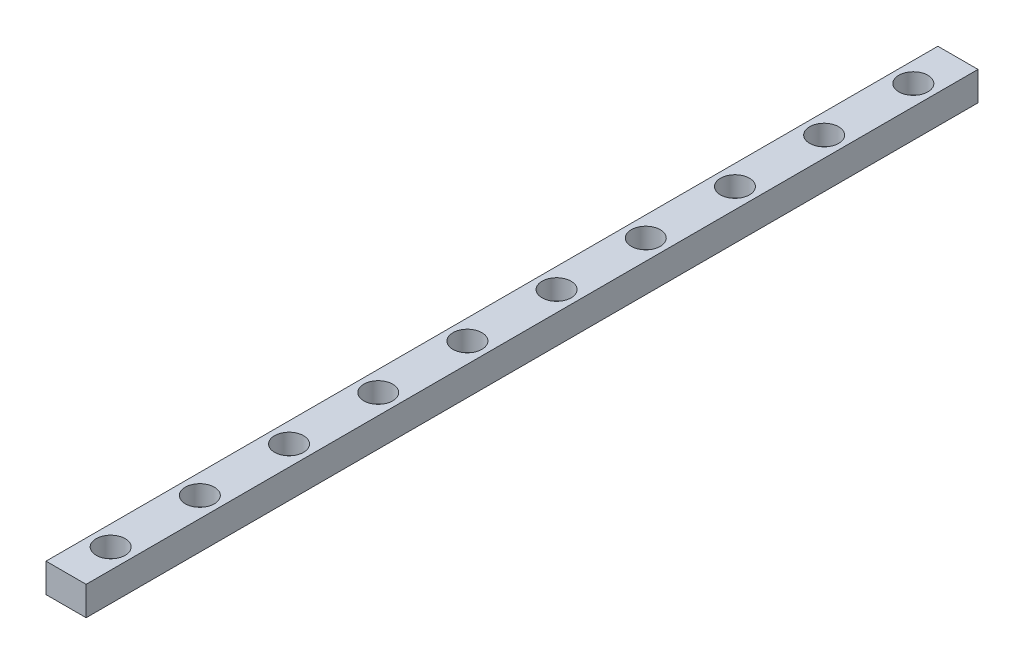
ISO-10303-21;
HEADER;
FILE_DESCRIPTION(('STEP AP214'),'2;1');
FILE_NAME('part.step','',(''),(''),'','','');
FILE_SCHEMA(('AUTOMOTIVE_DESIGN { 1 0 10303 214 1 1 1 1 }'));
ENDSEC;
DATA;
#1=APPLICATION_CONTEXT('core data for automotive mechanical design processes');
#2=APPLICATION_PROTOCOL_DEFINITION('international standard','automotive_design',2000,#1);
#3=PRODUCT_CONTEXT('',#1,'mechanical');
#4=PRODUCT('Part','Part','',(#3));
#5=PRODUCT_RELATED_PRODUCT_CATEGORY('part','',(#4));
#6=PRODUCT_DEFINITION_FORMATION('','',#4);
#7=PRODUCT_DEFINITION_CONTEXT('part definition',#1,'design');
#8=PRODUCT_DEFINITION('design','',#6,#7);
#9=PRODUCT_DEFINITION_SHAPE('','',#8);
#10=(LENGTH_UNIT() NAMED_UNIT(*) SI_UNIT(.MILLI.,.METRE.));
#11=(NAMED_UNIT(*) PLANE_ANGLE_UNIT() SI_UNIT($,.RADIAN.));
#12=(NAMED_UNIT(*) SI_UNIT($,.STERADIAN.) SOLID_ANGLE_UNIT());
#13=UNCERTAINTY_MEASURE_WITH_UNIT(LENGTH_MEASURE(1.E-05),#10,'distance_accuracy_value','');
#14=(GEOMETRIC_REPRESENTATION_CONTEXT(3) GLOBAL_UNCERTAINTY_ASSIGNED_CONTEXT((#13)) GLOBAL_UNIT_ASSIGNED_CONTEXT((#10,
#11,#12)) REPRESENTATION_CONTEXT('',''));
#15=CARTESIAN_POINT('',(0.,0.,0.));
#16=DIRECTION('',(0.,0.,1.));
#17=DIRECTION('',(1.,0.,0.));
#18=AXIS2_PLACEMENT_3D('',#15,#16,#17);
#19=CARTESIAN_POINT('',(0.,0.,200.000000000003));
#20=DIRECTION('',(1.,0.,0.));
#21=DIRECTION('',(0.,0.,-1.00000000000001));
#22=AXIS2_PLACEMENT_3D('',#19,#20,#21);
#23=PLANE('',#22);
#24=DIRECTION('',(0.,-1.00000000000001,0.));
#25=VECTOR('',#24,1.);
#26=CARTESIAN_POINT('',(0.,0.,0.));
#27=LINE('',#26,#25);
#28=CARTESIAN_POINT('',(0.,6.50000000000008,0.));
#29=VERTEX_POINT('',#28);
#30=CARTESIAN_POINT('',(0.,0.,0.));
#31=VERTEX_POINT('',#30);
#32=EDGE_CURVE('E97',#29,#31,#27,.T.);
#33=ORIENTED_EDGE('',*,*,#32,.T.);
#34=DIRECTION('',(0.,0.,-1.00000000000001));
#35=VECTOR('',#34,1.);
#36=CARTESIAN_POINT('',(0.,0.,200.000000000003));
#37=LINE('',#36,#35);
#38=CARTESIAN_POINT('',(0.,0.,200.000000000003));
#39=VERTEX_POINT('',#38);
#40=EDGE_CURVE('E11',#39,#31,#37,.T.);
#41=ORIENTED_EDGE('',*,*,#40,.F.);
#42=DIRECTION('',(0.,-1.00000000000001,0.));
#43=VECTOR('',#42,1.);
#44=CARTESIAN_POINT('',(0.,0.,200.000000000003));
#45=LINE('',#44,#43);
#46=CARTESIAN_POINT('',(0.,6.50000000000009,200.000000000003));
#47=VERTEX_POINT('',#46);
#48=EDGE_CURVE('E85',#47,#39,#45,.T.);
#49=ORIENTED_EDGE('',*,*,#48,.F.);
#50=DIRECTION('',(0.,0.,-1.00000000000001));
#51=VECTOR('',#50,1.);
#52=CARTESIAN_POINT('',(0.,6.50000000000009,200.000000000003));
#53=LINE('',#52,#51);
#54=EDGE_CURVE('E93',#47,#29,#53,.T.);
#55=ORIENTED_EDGE('',*,*,#54,.T.);
#56=EDGE_LOOP('',(#33,#41,#49,#55));
#57=FACE_BOUND('',#56,.T.);
#58=ADVANCED_FACE('F34',(#57),#23,.F.);
#59=CARTESIAN_POINT('',(0.,0.,200.000000000003));
#60=DIRECTION('',(0.,1.00000000000001,0.));
#61=DIRECTION('',(0.,0.,1.00000000000001));
#62=AXIS2_PLACEMENT_3D('',#59,#60,#61);
#63=PLANE('',#62);
#64=CARTESIAN_POINT('',(4.49999999999999,0.,190.000000000003));
#65=DIRECTION('',(0.,1.00000000000001,0.));
#66=DIRECTION('',(0.,0.,1.00000000000001));
#67=AXIS2_PLACEMENT_3D('',#64,#65,#66);
#68=CIRCLE('',#67,1.7);
#69=CARTESIAN_POINT('',(4.49999999999999,0.,191.700000000003));
#70=VERTEX_POINT('',#69);
#71=EDGE_CURVE('E218',#70,#70,#68,.T.);
#72=ORIENTED_EDGE('',*,*,#71,.T.);
#73=EDGE_LOOP('',(#72));
#74=FACE_BOUND('',#73,.T.);
#75=CARTESIAN_POINT('',(4.49999999999992,0.,170.000000000002));
#76=DIRECTION('',(0.,1.00000000000001,0.));
#77=DIRECTION('',(0.,0.,1.00000000000001));
#78=AXIS2_PLACEMENT_3D('',#75,#76,#77);
#79=CIRCLE('',#78,1.7);
#80=CARTESIAN_POINT('',(4.49999999999992,0.,171.700000000002));
#81=VERTEX_POINT('',#80);
#82=EDGE_CURVE('E206',#81,#81,#79,.T.);
#83=ORIENTED_EDGE('',*,*,#82,.T.);
#84=EDGE_LOOP('',(#83));
#85=FACE_BOUND('',#84,.T.);
#86=CARTESIAN_POINT('',(4.49999999999986,0.,150.000000000002));
#87=DIRECTION('',(0.,1.00000000000001,0.));
#88=DIRECTION('',(0.,0.,1.00000000000001));
#89=AXIS2_PLACEMENT_3D('',#86,#87,#88);
#90=CIRCLE('',#89,1.7);
#91=CARTESIAN_POINT('',(4.49999999999986,0.,151.700000000002));
#92=VERTEX_POINT('',#91);
#93=EDGE_CURVE('E194',#92,#92,#90,.T.);
#94=ORIENTED_EDGE('',*,*,#93,.T.);
#95=EDGE_LOOP('',(#94));
#96=FACE_BOUND('',#95,.T.);
#97=CARTESIAN_POINT('',(4.49999999999978,0.,130.000000000002));
#98=DIRECTION('',(0.,1.00000000000001,0.));
#99=DIRECTION('',(0.,0.,1.00000000000001));
#100=AXIS2_PLACEMENT_3D('',#97,#98,#99);
#101=CIRCLE('',#100,1.7);
#102=CARTESIAN_POINT('',(4.49999999999978,0.,131.700000000002));
#103=VERTEX_POINT('',#102);
#104=EDGE_CURVE('E182',#103,#103,#101,.T.);
#105=ORIENTED_EDGE('',*,*,#104,.T.);
#106=EDGE_LOOP('',(#105));
#107=FACE_BOUND('',#106,.T.);
#108=CARTESIAN_POINT('',(4.49999999999972,0.,110.000000000002));
#109=DIRECTION('',(0.,1.00000000000001,0.));
#110=DIRECTION('',(0.,0.,1.00000000000001));
#111=AXIS2_PLACEMENT_3D('',#108,#109,#110);
#112=CIRCLE('',#111,1.7);
#113=CARTESIAN_POINT('',(4.49999999999972,0.,111.700000000002));
#114=VERTEX_POINT('',#113);
#115=EDGE_CURVE('E170',#114,#114,#112,.T.);
#116=ORIENTED_EDGE('',*,*,#115,.T.);
#117=EDGE_LOOP('',(#116));
#118=FACE_BOUND('',#117,.T.);
#119=CARTESIAN_POINT('',(4.49999999999964,0.,90.000000000001));
#120=DIRECTION('',(0.,1.00000000000001,0.));
#121=DIRECTION('',(0.,0.,1.00000000000001));
#122=AXIS2_PLACEMENT_3D('',#119,#120,#121);
#123=CIRCLE('',#122,1.7);
#124=CARTESIAN_POINT('',(4.49999999999964,0.,91.700000000001));
#125=VERTEX_POINT('',#124);
#126=EDGE_CURVE('E158',#125,#125,#123,.T.);
#127=ORIENTED_EDGE('',*,*,#126,.T.);
#128=EDGE_LOOP('',(#127));
#129=FACE_BOUND('',#128,.T.);
#130=CARTESIAN_POINT('',(4.49999999999958,0.,70.0000000000006));
#131=DIRECTION('',(0.,1.00000000000001,0.));
#132=DIRECTION('',(0.,0.,1.00000000000001));
#133=AXIS2_PLACEMENT_3D('',#130,#131,#132);
#134=CIRCLE('',#133,1.7);
#135=CARTESIAN_POINT('',(4.49999999999958,0.,71.7000000000007));
#136=VERTEX_POINT('',#135);
#137=EDGE_CURVE('E146',#136,#136,#134,.T.);
#138=ORIENTED_EDGE('',*,*,#137,.T.);
#139=EDGE_LOOP('',(#138));
#140=FACE_BOUND('',#139,.T.);
#141=CARTESIAN_POINT('',(4.49999999999951,0.,50.0000000000007));
#142=DIRECTION('',(0.,1.00000000000001,0.));
#143=DIRECTION('',(0.,0.,1.00000000000001));
#144=AXIS2_PLACEMENT_3D('',#141,#142,#143);
#145=CIRCLE('',#144,1.7);
#146=CARTESIAN_POINT('',(4.49999999999951,0.,51.7000000000007));
#147=VERTEX_POINT('',#146);
#148=EDGE_CURVE('E134',#147,#147,#145,.T.);
#149=ORIENTED_EDGE('',*,*,#148,.T.);
#150=EDGE_LOOP('',(#149));
#151=FACE_BOUND('',#150,.T.);
#152=CARTESIAN_POINT('',(4.49999999999945,0.,30.0000000000006));
#153=DIRECTION('',(0.,1.00000000000001,0.));
#154=DIRECTION('',(0.,0.,1.00000000000001));
#155=AXIS2_PLACEMENT_3D('',#152,#153,#154);
#156=CIRCLE('',#155,1.7);
#157=CARTESIAN_POINT('',(4.49999999999945,0.,31.7000000000006));
#158=VERTEX_POINT('',#157);
#159=EDGE_CURVE('E122',#158,#158,#156,.T.);
#160=ORIENTED_EDGE('',*,*,#159,.T.);
#161=EDGE_LOOP('',(#160));
#162=FACE_BOUND('',#161,.T.);
#163=CARTESIAN_POINT('',(4.49999999999937,0.,10.));
#164=DIRECTION('',(0.,1.00000000000001,0.));
#165=DIRECTION('',(0.,0.,1.00000000000001));
#166=AXIS2_PLACEMENT_3D('',#163,#164,#165);
#167=CIRCLE('',#166,1.7);
#168=CARTESIAN_POINT('',(4.49999999999937,0.,11.7));
#169=VERTEX_POINT('',#168);
#170=EDGE_CURVE('E100',#169,#169,#167,.T.);
#171=ORIENTED_EDGE('',*,*,#170,.T.);
#172=EDGE_LOOP('',(#171));
#173=FACE_BOUND('',#172,.T.);
#174=DIRECTION('',(1.,0.,0.));
#175=VECTOR('',#174,1.);
#176=CARTESIAN_POINT('',(0.,0.,0.));
#177=LINE('',#176,#175);
#178=CARTESIAN_POINT('',(9.,0.,0.));
#179=VERTEX_POINT('',#178);
#180=EDGE_CURVE('E89',#31,#179,#177,.T.);
#181=ORIENTED_EDGE('',*,*,#180,.T.);
#182=DIRECTION('',(0.,0.,-1.00000000000001));
#183=VECTOR('',#182,1.);
#184=CARTESIAN_POINT('',(8.99999999999999,0.,200.000000000003));
#185=LINE('',#184,#183);
#186=CARTESIAN_POINT('',(8.99999999999999,0.,200.000000000003));
#187=VERTEX_POINT('',#186);
#188=EDGE_CURVE('E42',#187,#179,#185,.T.);
#189=ORIENTED_EDGE('',*,*,#188,.F.);
#190=DIRECTION('',(1.,0.,0.));
#191=VECTOR('',#190,1.);
#192=CARTESIAN_POINT('',(0.,0.,200.000000000003));
#193=LINE('',#192,#191);
#194=EDGE_CURVE('E80',#39,#187,#193,.T.);
#195=ORIENTED_EDGE('',*,*,#194,.F.);
#196=ORIENTED_EDGE('',*,*,#40,.T.);
#197=EDGE_LOOP('',(#181,#189,#195,#196));
#198=FACE_BOUND('',#197,.T.);
#199=ADVANCED_FACE('F88',(#74,#85,#96,#107,#118,#129,#140,#151,#162,#173,#198),#63,.F.);
#200=CARTESIAN_POINT('',(8.99999999999999,0.,200.000000000003));
#201=DIRECTION('',(-1.,0.,0.));
#202=DIRECTION('',(0.,0.,1.00000000000001));
#203=AXIS2_PLACEMENT_3D('',#200,#201,#202);
#204=PLANE('',#203);
#205=DIRECTION('',(0.,1.00000000000001,0.));
#206=VECTOR('',#205,1.);
#207=CARTESIAN_POINT('',(9.,0.,0.));
#208=LINE('',#207,#206);
#209=CARTESIAN_POINT('',(9.,6.50000000000008,0.));
#210=VERTEX_POINT('',#209);
#211=EDGE_CURVE('E67',#179,#210,#208,.T.);
#212=ORIENTED_EDGE('',*,*,#211,.T.);
#213=DIRECTION('',(0.,0.,-1.00000000000001));
#214=VECTOR('',#213,1.);
#215=CARTESIAN_POINT('',(8.99999999999999,6.50000000000009,200.000000000003));
#216=LINE('',#215,#214);
#217=CARTESIAN_POINT('',(8.99999999999999,6.50000000000009,200.000000000003));
#218=VERTEX_POINT('',#217);
#219=EDGE_CURVE('E90',#218,#210,#216,.T.);
#220=ORIENTED_EDGE('',*,*,#219,.F.);
#221=DIRECTION('',(0.,1.00000000000001,0.));
#222=VECTOR('',#221,1.);
#223=CARTESIAN_POINT('',(8.99999999999999,0.,200.000000000003));
#224=LINE('',#223,#222);
#225=EDGE_CURVE('E83',#187,#218,#224,.T.);
#226=ORIENTED_EDGE('',*,*,#225,.F.);
#227=ORIENTED_EDGE('',*,*,#188,.T.);
#228=EDGE_LOOP('',(#212,#220,#226,#227));
#229=FACE_BOUND('',#228,.T.);
#230=ADVANCED_FACE('F91',(#229),#204,.F.);
#231=CARTESIAN_POINT('',(0.,6.50000000000009,200.000000000003));
#232=DIRECTION('',(0.,-1.00000000000001,0.));
#233=DIRECTION('',(0.,0.,-1.00000000000001));
#234=AXIS2_PLACEMENT_3D('',#231,#232,#233);
#235=PLANE('',#234);
#236=CARTESIAN_POINT('',(4.49999999999999,6.50000000000009,190.000000000003));
#237=DIRECTION('',(0.,1.00000000000001,0.));
#238=DIRECTION('',(0.,0.,1.00000000000001));
#239=AXIS2_PLACEMENT_3D('',#236,#237,#238);
#240=CIRCLE('',#239,3.25);
#241=CARTESIAN_POINT('',(4.49999999999999,6.50000000000009,193.250000000003));
#242=VERTEX_POINT('',#241);
#243=EDGE_CURVE('E227',#242,#242,#240,.T.);
#244=ORIENTED_EDGE('',*,*,#243,.F.);
#245=EDGE_LOOP('',(#244));
#246=FACE_BOUND('',#245,.T.);
#247=CARTESIAN_POINT('',(4.49999999999992,6.50000000000011,170.000000000002));
#248=DIRECTION('',(0.,1.00000000000001,0.));
#249=DIRECTION('',(0.,0.,1.00000000000001));
#250=AXIS2_PLACEMENT_3D('',#247,#248,#249);
#251=CIRCLE('',#250,3.25);
#252=CARTESIAN_POINT('',(4.49999999999992,6.50000000000011,173.250000000002));
#253=VERTEX_POINT('',#252);
#254=EDGE_CURVE('E215',#253,#253,#251,.T.);
#255=ORIENTED_EDGE('',*,*,#254,.F.);
#256=EDGE_LOOP('',(#255));
#257=FACE_BOUND('',#256,.T.);
#258=CARTESIAN_POINT('',(4.49999999999987,6.50000000000011,150.000000000002));
#259=DIRECTION('',(0.,1.00000000000001,0.));
#260=DIRECTION('',(0.,0.,1.00000000000001));
#261=AXIS2_PLACEMENT_3D('',#258,#259,#260);
#262=CIRCLE('',#261,3.25);
#263=CARTESIAN_POINT('',(4.49999999999987,6.50000000000011,153.250000000002));
#264=VERTEX_POINT('',#263);
#265=EDGE_CURVE('E203',#264,#264,#262,.T.);
#266=ORIENTED_EDGE('',*,*,#265,.F.);
#267=EDGE_LOOP('',(#266));
#268=FACE_BOUND('',#267,.T.);
#269=CARTESIAN_POINT('',(4.49999999999978,6.50000000000008,130.000000000002));
#270=DIRECTION('',(0.,1.00000000000001,0.));
#271=DIRECTION('',(0.,0.,1.00000000000001));
#272=AXIS2_PLACEMENT_3D('',#269,#270,#271);
#273=CIRCLE('',#272,3.25);
#274=CARTESIAN_POINT('',(4.49999999999978,6.50000000000008,133.250000000002));
#275=VERTEX_POINT('',#274);
#276=EDGE_CURVE('E191',#275,#275,#273,.T.);
#277=ORIENTED_EDGE('',*,*,#276,.F.);
#278=EDGE_LOOP('',(#277));
#279=FACE_BOUND('',#278,.T.);
#280=CARTESIAN_POINT('',(4.49999999999971,6.50000000000011,110.000000000002));
#281=DIRECTION('',(0.,1.00000000000001,0.));
#282=DIRECTION('',(0.,0.,1.00000000000001));
#283=AXIS2_PLACEMENT_3D('',#280,#281,#282);
#284=CIRCLE('',#283,3.25);
#285=CARTESIAN_POINT('',(4.49999999999971,6.50000000000011,113.250000000002));
#286=VERTEX_POINT('',#285);
#287=EDGE_CURVE('E179',#286,#286,#284,.T.);
#288=ORIENTED_EDGE('',*,*,#287,.F.);
#289=EDGE_LOOP('',(#288));
#290=FACE_BOUND('',#289,.T.);
#291=CARTESIAN_POINT('',(4.49999999999965,6.50000000000011,90.000000000001));
#292=DIRECTION('',(0.,1.00000000000001,0.));
#293=DIRECTION('',(0.,0.,1.00000000000001));
#294=AXIS2_PLACEMENT_3D('',#291,#292,#293);
#295=CIRCLE('',#294,3.25);
#296=CARTESIAN_POINT('',(4.49999999999965,6.50000000000011,93.250000000001));
#297=VERTEX_POINT('',#296);
#298=EDGE_CURVE('E167',#297,#297,#295,.T.);
#299=ORIENTED_EDGE('',*,*,#298,.F.);
#300=EDGE_LOOP('',(#299));
#301=FACE_BOUND('',#300,.T.);
#302=CARTESIAN_POINT('',(4.49999999999958,6.50000000000009,70.0000000000006));
#303=DIRECTION('',(0.,1.00000000000001,0.));
#304=DIRECTION('',(0.,0.,1.00000000000001));
#305=AXIS2_PLACEMENT_3D('',#302,#303,#304);
#306=CIRCLE('',#305,3.25);
#307=CARTESIAN_POINT('',(4.49999999999958,6.50000000000009,73.2500000000007));
#308=VERTEX_POINT('',#307);
#309=EDGE_CURVE('E155',#308,#308,#306,.T.);
#310=ORIENTED_EDGE('',*,*,#309,.F.);
#311=EDGE_LOOP('',(#310));
#312=FACE_BOUND('',#311,.T.);
#313=CARTESIAN_POINT('',(4.49999999999951,6.50000000000009,50.0000000000007));
#314=DIRECTION('',(0.,1.00000000000001,0.));
#315=DIRECTION('',(0.,0.,1.00000000000001));
#316=AXIS2_PLACEMENT_3D('',#313,#314,#315);
#317=CIRCLE('',#316,3.25);
#318=CARTESIAN_POINT('',(4.49999999999951,6.50000000000009,53.2500000000007));
#319=VERTEX_POINT('',#318);
#320=EDGE_CURVE('E143',#319,#319,#317,.T.);
#321=ORIENTED_EDGE('',*,*,#320,.F.);
#322=EDGE_LOOP('',(#321));
#323=FACE_BOUND('',#322,.T.);
#324=CARTESIAN_POINT('',(4.49999999999944,6.50000000000011,30.0000000000007));
#325=DIRECTION('',(0.,1.00000000000001,0.));
#326=DIRECTION('',(0.,0.,1.00000000000001));
#327=AXIS2_PLACEMENT_3D('',#324,#325,#326);
#328=CIRCLE('',#327,3.25);
#329=CARTESIAN_POINT('',(4.49999999999944,6.50000000000011,33.2500000000007));
#330=VERTEX_POINT('',#329);
#331=EDGE_CURVE('E131',#330,#330,#328,.T.);
#332=ORIENTED_EDGE('',*,*,#331,.F.);
#333=EDGE_LOOP('',(#332));
#334=FACE_BOUND('',#333,.T.);
#335=CARTESIAN_POINT('',(4.49999999999937,6.5000000000001,10.));
#336=DIRECTION('',(0.,1.00000000000001,0.));
#337=DIRECTION('',(0.,0.,1.00000000000001));
#338=AXIS2_PLACEMENT_3D('',#335,#336,#337);
#339=CIRCLE('',#338,3.25);
#340=CARTESIAN_POINT('',(4.49999999999937,6.5000000000001,13.25));
#341=VERTEX_POINT('',#340);
#342=EDGE_CURVE('E119',#341,#341,#339,.T.);
#343=ORIENTED_EDGE('',*,*,#342,.F.);
#344=EDGE_LOOP('',(#343));
#345=FACE_BOUND('',#344,.T.);
#346=DIRECTION('',(-1.,0.,0.));
#347=VECTOR('',#346,1.);
#348=CARTESIAN_POINT('',(0.,6.50000000000008,0.));
#349=LINE('',#348,#347);
#350=EDGE_CURVE('E73',#210,#29,#349,.T.);
#351=ORIENTED_EDGE('',*,*,#350,.T.);
#352=ORIENTED_EDGE('',*,*,#54,.F.);
#353=DIRECTION('',(-1.,0.,0.));
#354=VECTOR('',#353,1.);
#355=CARTESIAN_POINT('',(0.,6.50000000000009,200.000000000003));
#356=LINE('',#355,#354);
#357=EDGE_CURVE('E50',#218,#47,#356,.T.);
#358=ORIENTED_EDGE('',*,*,#357,.F.);
#359=ORIENTED_EDGE('',*,*,#219,.T.);
#360=EDGE_LOOP('',(#351,#352,#358,#359));
#361=FACE_BOUND('',#360,.T.);
#362=ADVANCED_FACE('F105',(#246,#257,#268,#279,#290,#301,#312,#323,#334,#345,#361),#235,.F.);
#363=CARTESIAN_POINT('',(0.,0.,200.000000000003));
#364=DIRECTION('',(0.,0.,-1.00000000000001));
#365=DIRECTION('',(-1.,0.,0.));
#366=AXIS2_PLACEMENT_3D('',#363,#364,#365);
#367=PLANE('',#366);
#368=ORIENTED_EDGE('',*,*,#48,.T.);
#369=ORIENTED_EDGE('',*,*,#194,.T.);
#370=ORIENTED_EDGE('',*,*,#225,.T.);
#371=ORIENTED_EDGE('',*,*,#357,.T.);
#372=EDGE_LOOP('',(#368,#369,#370,#371));
#373=FACE_BOUND('',#372,.T.);
#374=ADVANCED_FACE('F81',(#373),#367,.F.);
#375=CARTESIAN_POINT('',(0.,0.,0.));
#376=DIRECTION('',(0.,0.,-1.00000000000001));
#377=DIRECTION('',(-1.,0.,0.));
#378=AXIS2_PLACEMENT_3D('',#375,#376,#377);
#379=PLANE('',#378);
#380=ORIENTED_EDGE('',*,*,#32,.F.);
#381=ORIENTED_EDGE('',*,*,#350,.F.);
#382=ORIENTED_EDGE('',*,*,#211,.F.);
#383=ORIENTED_EDGE('',*,*,#180,.F.);
#384=EDGE_LOOP('',(#380,#381,#382,#383));
#385=FACE_BOUND('',#384,.T.);
#386=ADVANCED_FACE('F108',(#385),#379,.T.);
#387=CARTESIAN_POINT('',(4.49999999999937,6.5000000000001,10.));
#388=DIRECTION('',(0.,1.00000000000001,0.));
#389=DIRECTION('',(0.,0.,1.00000000000001));
#390=AXIS2_PLACEMENT_3D('',#387,#388,#389);
#391=CYLINDRICAL_SURFACE('',#390,1.7);
#392=ORIENTED_EDGE('',*,*,#170,.F.);
#393=EDGE_LOOP('',(#392));
#394=FACE_BOUND('',#393,.T.);
#395=CARTESIAN_POINT('',(4.49999999999935,2.00000000000004,10.));
#396=DIRECTION('',(0.,1.00000000000001,0.));
#397=DIRECTION('',(0.,0.,1.00000000000001));
#398=AXIS2_PLACEMENT_3D('',#395,#396,#397);
#399=CIRCLE('',#398,1.7);
#400=CARTESIAN_POINT('',(4.49999999999935,2.00000000000004,11.7));
#401=VERTEX_POINT('',#400);
#402=EDGE_CURVE('E113',#401,#401,#399,.T.);
#403=ORIENTED_EDGE('',*,*,#402,.T.);
#404=EDGE_LOOP('',(#403));
#405=FACE_BOUND('',#404,.T.);
#406=ADVANCED_FACE('F267',(#394,#405),#391,.F.);
#407=CARTESIAN_POINT('',(6.19999999999935,2.00000000000004,10.));
#408=DIRECTION('',(0.,-1.00000000000001,0.));
#409=DIRECTION('',(0.,0.,-1.00000000000001));
#410=AXIS2_PLACEMENT_3D('',#407,#408,#409);
#411=PLANE('',#410);
#412=ORIENTED_EDGE('',*,*,#402,.F.);
#413=EDGE_LOOP('',(#412));
#414=FACE_BOUND('',#413,.T.);
#415=CARTESIAN_POINT('',(4.49999999999935,2.00000000000004,10.));
#416=DIRECTION('',(0.,1.00000000000001,0.));
#417=DIRECTION('',(0.,0.,1.00000000000001));
#418=AXIS2_PLACEMENT_3D('',#415,#416,#417);
#419=CIRCLE('',#418,3.25);
#420=CARTESIAN_POINT('',(4.49999999999935,2.00000000000004,13.25));
#421=VERTEX_POINT('',#420);
#422=EDGE_CURVE('E116',#421,#421,#419,.T.);
#423=ORIENTED_EDGE('',*,*,#422,.T.);
#424=EDGE_LOOP('',(#423));
#425=FACE_BOUND('',#424,.T.);
#426=ADVANCED_FACE('F257',(#414,#425),#411,.F.);
#427=CARTESIAN_POINT('',(4.49999999999937,6.5000000000001,10.));
#428=DIRECTION('',(0.,1.00000000000001,0.));
#429=DIRECTION('',(0.,0.,1.00000000000001));
#430=AXIS2_PLACEMENT_3D('',#427,#428,#429);
#431=CYLINDRICAL_SURFACE('',#430,3.25);
#432=ORIENTED_EDGE('',*,*,#422,.F.);
#433=EDGE_LOOP('',(#432));
#434=FACE_BOUND('',#433,.T.);
#435=ORIENTED_EDGE('',*,*,#342,.T.);
#436=EDGE_LOOP('',(#435));
#437=FACE_BOUND('',#436,.T.);
#438=ADVANCED_FACE('F254',(#434,#437),#431,.F.);
#439=CARTESIAN_POINT('',(4.49999999999944,6.50000000000011,30.0000000000007));
#440=DIRECTION('',(0.,1.00000000000001,0.));
#441=DIRECTION('',(0.,0.,1.00000000000001));
#442=AXIS2_PLACEMENT_3D('',#439,#440,#441);
#443=CYLINDRICAL_SURFACE('',#442,1.7);
#444=ORIENTED_EDGE('',*,*,#159,.F.);
#445=EDGE_LOOP('',(#444));
#446=FACE_BOUND('',#445,.T.);
#447=CARTESIAN_POINT('',(4.49999999999942,2.00000000000004,30.0000000000007));
#448=DIRECTION('',(0.,1.00000000000001,0.));
#449=DIRECTION('',(0.,0.,1.00000000000001));
#450=AXIS2_PLACEMENT_3D('',#447,#448,#449);
#451=CIRCLE('',#450,1.7);
#452=CARTESIAN_POINT('',(4.49999999999942,2.00000000000004,31.7000000000007));
#453=VERTEX_POINT('',#452);
#454=EDGE_CURVE('E125',#453,#453,#451,.T.);
#455=ORIENTED_EDGE('',*,*,#454,.T.);
#456=EDGE_LOOP('',(#455));
#457=FACE_BOUND('',#456,.T.);
#458=ADVANCED_FACE('F256',(#446,#457),#443,.F.);
#459=CARTESIAN_POINT('',(6.19999999999941,2.00000000000004,30.0000000000007));
#460=DIRECTION('',(0.,-1.00000000000001,0.));
#461=DIRECTION('',(0.,0.,-1.00000000000001));
#462=AXIS2_PLACEMENT_3D('',#459,#460,#461);
#463=PLANE('',#462);
#464=ORIENTED_EDGE('',*,*,#454,.F.);
#465=EDGE_LOOP('',(#464));
#466=FACE_BOUND('',#465,.T.);
#467=CARTESIAN_POINT('',(4.49999999999942,2.00000000000004,30.0000000000007));
#468=DIRECTION('',(0.,1.00000000000001,0.));
#469=DIRECTION('',(0.,0.,1.00000000000001));
#470=AXIS2_PLACEMENT_3D('',#467,#468,#469);
#471=CIRCLE('',#470,3.25);
#472=CARTESIAN_POINT('',(4.49999999999942,2.00000000000004,33.2500000000007));
#473=VERTEX_POINT('',#472);
#474=EDGE_CURVE('E128',#473,#473,#471,.T.);
#475=ORIENTED_EDGE('',*,*,#474,.T.);
#476=EDGE_LOOP('',(#475));
#477=FACE_BOUND('',#476,.T.);
#478=ADVANCED_FACE('F264',(#466,#477),#463,.F.);
#479=CARTESIAN_POINT('',(4.49999999999944,6.50000000000011,30.0000000000007));
#480=DIRECTION('',(0.,1.00000000000001,0.));
#481=DIRECTION('',(0.,0.,1.00000000000001));
#482=AXIS2_PLACEMENT_3D('',#479,#480,#481);
#483=CYLINDRICAL_SURFACE('',#482,3.25);
#484=ORIENTED_EDGE('',*,*,#474,.F.);
#485=EDGE_LOOP('',(#484));
#486=FACE_BOUND('',#485,.T.);
#487=ORIENTED_EDGE('',*,*,#331,.T.);
#488=EDGE_LOOP('',(#487));
#489=FACE_BOUND('',#488,.T.);
#490=ADVANCED_FACE('F320',(#486,#489),#483,.F.);
#491=CARTESIAN_POINT('',(4.49999999999951,6.50000000000009,50.0000000000007));
#492=DIRECTION('',(0.,1.00000000000001,0.));
#493=DIRECTION('',(0.,0.,1.00000000000001));
#494=AXIS2_PLACEMENT_3D('',#491,#492,#493);
#495=CYLINDRICAL_SURFACE('',#494,1.7);
#496=ORIENTED_EDGE('',*,*,#148,.F.);
#497=EDGE_LOOP('',(#496));
#498=FACE_BOUND('',#497,.T.);
#499=CARTESIAN_POINT('',(4.49999999999949,2.00000000000002,50.0000000000007));
#500=DIRECTION('',(0.,1.00000000000001,0.));
#501=DIRECTION('',(0.,0.,1.00000000000001));
#502=AXIS2_PLACEMENT_3D('',#499,#500,#501);
#503=CIRCLE('',#502,1.7);
#504=CARTESIAN_POINT('',(4.49999999999949,2.00000000000002,51.7000000000007));
#505=VERTEX_POINT('',#504);
#506=EDGE_CURVE('E137',#505,#505,#503,.T.);
#507=ORIENTED_EDGE('',*,*,#506,.T.);
#508=EDGE_LOOP('',(#507));
#509=FACE_BOUND('',#508,.T.);
#510=ADVANCED_FACE('F330',(#498,#509),#495,.F.);
#511=CARTESIAN_POINT('',(6.19999999999949,2.00000000000004,50.0000000000006));
#512=DIRECTION('',(0.,-1.00000000000001,0.));
#513=DIRECTION('',(0.,0.,-1.00000000000001));
#514=AXIS2_PLACEMENT_3D('',#511,#512,#513);
#515=PLANE('',#514);
#516=ORIENTED_EDGE('',*,*,#506,.F.);
#517=EDGE_LOOP('',(#516));
#518=FACE_BOUND('',#517,.T.);
#519=CARTESIAN_POINT('',(4.49999999999949,2.00000000000002,50.0000000000007));
#520=DIRECTION('',(0.,1.00000000000001,0.));
#521=DIRECTION('',(0.,0.,1.00000000000001));
#522=AXIS2_PLACEMENT_3D('',#519,#520,#521);
#523=CIRCLE('',#522,3.25);
#524=CARTESIAN_POINT('',(4.49999999999949,2.00000000000002,53.2500000000007));
#525=VERTEX_POINT('',#524);
#526=EDGE_CURVE('E140',#525,#525,#523,.T.);
#527=ORIENTED_EDGE('',*,*,#526,.T.);
#528=EDGE_LOOP('',(#527));
#529=FACE_BOUND('',#528,.T.);
#530=ADVANCED_FACE('F340',(#518,#529),#515,.F.);
#531=CARTESIAN_POINT('',(4.49999999999951,6.50000000000009,50.0000000000007));
#532=DIRECTION('',(0.,1.00000000000001,0.));
#533=DIRECTION('',(0.,0.,1.00000000000001));
#534=AXIS2_PLACEMENT_3D('',#531,#532,#533);
#535=CYLINDRICAL_SURFACE('',#534,3.25);
#536=ORIENTED_EDGE('',*,*,#526,.F.);
#537=EDGE_LOOP('',(#536));
#538=FACE_BOUND('',#537,.T.);
#539=ORIENTED_EDGE('',*,*,#320,.T.);
#540=EDGE_LOOP('',(#539));
#541=FACE_BOUND('',#540,.T.);
#542=ADVANCED_FACE('F350',(#538,#541),#535,.F.);
#543=CARTESIAN_POINT('',(4.49999999999958,6.50000000000009,70.0000000000006));
#544=DIRECTION('',(0.,1.00000000000001,0.));
#545=DIRECTION('',(0.,0.,1.00000000000001));
#546=AXIS2_PLACEMENT_3D('',#543,#544,#545);
#547=CYLINDRICAL_SURFACE('',#546,1.7);
#548=ORIENTED_EDGE('',*,*,#137,.F.);
#549=EDGE_LOOP('',(#548));
#550=FACE_BOUND('',#549,.T.);
#551=CARTESIAN_POINT('',(4.49999999999956,2.00000000000004,70.0000000000006));
#552=DIRECTION('',(0.,1.00000000000001,0.));
#553=DIRECTION('',(0.,0.,1.00000000000001));
#554=AXIS2_PLACEMENT_3D('',#551,#552,#553);
#555=CIRCLE('',#554,1.7);
#556=CARTESIAN_POINT('',(4.49999999999956,2.00000000000004,71.7000000000007));
#557=VERTEX_POINT('',#556);
#558=EDGE_CURVE('E149',#557,#557,#555,.T.);
#559=ORIENTED_EDGE('',*,*,#558,.T.);
#560=EDGE_LOOP('',(#559));
#561=FACE_BOUND('',#560,.T.);
#562=ADVANCED_FACE('F360',(#550,#561),#547,.F.);
#563=CARTESIAN_POINT('',(6.19999999999956,2.00000000000004,70.0000000000006));
#564=DIRECTION('',(0.,-1.00000000000001,0.));
#565=DIRECTION('',(0.,0.,-1.00000000000001));
#566=AXIS2_PLACEMENT_3D('',#563,#564,#565);
#567=PLANE('',#566);
#568=ORIENTED_EDGE('',*,*,#558,.F.);
#569=EDGE_LOOP('',(#568));
#570=FACE_BOUND('',#569,.T.);
#571=CARTESIAN_POINT('',(4.49999999999956,2.00000000000004,70.0000000000006));
#572=DIRECTION('',(0.,1.00000000000001,0.));
#573=DIRECTION('',(0.,0.,1.00000000000001));
#574=AXIS2_PLACEMENT_3D('',#571,#572,#573);
#575=CIRCLE('',#574,3.25);
#576=CARTESIAN_POINT('',(4.49999999999956,2.00000000000004,73.2500000000007));
#577=VERTEX_POINT('',#576);
#578=EDGE_CURVE('E152',#577,#577,#575,.T.);
#579=ORIENTED_EDGE('',*,*,#578,.T.);
#580=EDGE_LOOP('',(#579));
#581=FACE_BOUND('',#580,.T.);
#582=ADVANCED_FACE('F370',(#570,#581),#567,.F.);
#583=CARTESIAN_POINT('',(4.49999999999958,6.50000000000009,70.0000000000006));
#584=DIRECTION('',(0.,1.00000000000001,0.));
#585=DIRECTION('',(0.,0.,1.00000000000001));
#586=AXIS2_PLACEMENT_3D('',#583,#584,#585);
#587=CYLINDRICAL_SURFACE('',#586,3.25);
#588=ORIENTED_EDGE('',*,*,#578,.F.);
#589=EDGE_LOOP('',(#588));
#590=FACE_BOUND('',#589,.T.);
#591=ORIENTED_EDGE('',*,*,#309,.T.);
#592=EDGE_LOOP('',(#591));
#593=FACE_BOUND('',#592,.T.);
#594=ADVANCED_FACE('F380',(#590,#593),#587,.F.);
#595=CARTESIAN_POINT('',(4.49999999999965,6.50000000000011,90.000000000001));
#596=DIRECTION('',(0.,1.00000000000001,0.));
#597=DIRECTION('',(0.,0.,1.00000000000001));
#598=AXIS2_PLACEMENT_3D('',#595,#596,#597);
#599=CYLINDRICAL_SURFACE('',#598,1.7);
#600=ORIENTED_EDGE('',*,*,#126,.F.);
#601=EDGE_LOOP('',(#600));
#602=FACE_BOUND('',#601,.T.);
#603=CARTESIAN_POINT('',(4.49999999999963,2.00000000000004,90.000000000001));
#604=DIRECTION('',(0.,1.00000000000001,0.));
#605=DIRECTION('',(0.,0.,1.00000000000001));
#606=AXIS2_PLACEMENT_3D('',#603,#604,#605);
#607=CIRCLE('',#606,1.7);
#608=CARTESIAN_POINT('',(4.49999999999963,2.00000000000004,91.700000000001));
#609=VERTEX_POINT('',#608);
#610=EDGE_CURVE('E161',#609,#609,#607,.T.);
#611=ORIENTED_EDGE('',*,*,#610,.T.);
#612=EDGE_LOOP('',(#611));
#613=FACE_BOUND('',#612,.T.);
#614=ADVANCED_FACE('F390',(#602,#613),#599,.F.);
#615=CARTESIAN_POINT('',(6.19999999999963,2.00000000000004,90.000000000001));
#616=DIRECTION('',(0.,-1.00000000000001,0.));
#617=DIRECTION('',(0.,0.,-1.00000000000001));
#618=AXIS2_PLACEMENT_3D('',#615,#616,#617);
#619=PLANE('',#618);
#620=ORIENTED_EDGE('',*,*,#610,.F.);
#621=EDGE_LOOP('',(#620));
#622=FACE_BOUND('',#621,.T.);
#623=CARTESIAN_POINT('',(4.49999999999963,2.00000000000004,90.000000000001));
#624=DIRECTION('',(0.,1.00000000000001,0.));
#625=DIRECTION('',(0.,0.,1.00000000000001));
#626=AXIS2_PLACEMENT_3D('',#623,#624,#625);
#627=CIRCLE('',#626,3.25);
#628=CARTESIAN_POINT('',(4.49999999999963,2.00000000000004,93.250000000001));
#629=VERTEX_POINT('',#628);
#630=EDGE_CURVE('E164',#629,#629,#627,.T.);
#631=ORIENTED_EDGE('',*,*,#630,.T.);
#632=EDGE_LOOP('',(#631));
#633=FACE_BOUND('',#632,.T.);
#634=ADVANCED_FACE('F400',(#622,#633),#619,.F.);
#635=CARTESIAN_POINT('',(4.49999999999965,6.50000000000011,90.000000000001));
#636=DIRECTION('',(0.,1.00000000000001,0.));
#637=DIRECTION('',(0.,0.,1.00000000000001));
#638=AXIS2_PLACEMENT_3D('',#635,#636,#637);
#639=CYLINDRICAL_SURFACE('',#638,3.25);
#640=ORIENTED_EDGE('',*,*,#630,.F.);
#641=EDGE_LOOP('',(#640));
#642=FACE_BOUND('',#641,.T.);
#643=ORIENTED_EDGE('',*,*,#298,.T.);
#644=EDGE_LOOP('',(#643));
#645=FACE_BOUND('',#644,.T.);
#646=ADVANCED_FACE('F410',(#642,#645),#639,.F.);
#647=CARTESIAN_POINT('',(4.49999999999971,6.50000000000011,110.000000000002));
#648=DIRECTION('',(0.,1.00000000000001,0.));
#649=DIRECTION('',(0.,0.,1.00000000000001));
#650=AXIS2_PLACEMENT_3D('',#647,#648,#649);
#651=CYLINDRICAL_SURFACE('',#650,1.7);
#652=ORIENTED_EDGE('',*,*,#115,.F.);
#653=EDGE_LOOP('',(#652));
#654=FACE_BOUND('',#653,.T.);
#655=CARTESIAN_POINT('',(4.49999999999969,2.00000000000004,110.000000000002));
#656=DIRECTION('',(0.,1.00000000000001,0.));
#657=DIRECTION('',(0.,0.,1.00000000000001));
#658=AXIS2_PLACEMENT_3D('',#655,#656,#657);
#659=CIRCLE('',#658,1.7);
#660=CARTESIAN_POINT('',(4.49999999999969,2.00000000000004,111.700000000002));
#661=VERTEX_POINT('',#660);
#662=EDGE_CURVE('E173',#661,#661,#659,.T.);
#663=ORIENTED_EDGE('',*,*,#662,.T.);
#664=EDGE_LOOP('',(#663));
#665=FACE_BOUND('',#664,.T.);
#666=ADVANCED_FACE('F420',(#654,#665),#651,.F.);
#667=CARTESIAN_POINT('',(6.19999999999969,2.00000000000004,110.000000000002));
#668=DIRECTION('',(0.,-1.00000000000001,0.));
#669=DIRECTION('',(0.,0.,-1.00000000000001));
#670=AXIS2_PLACEMENT_3D('',#667,#668,#669);
#671=PLANE('',#670);
#672=ORIENTED_EDGE('',*,*,#662,.F.);
#673=EDGE_LOOP('',(#672));
#674=FACE_BOUND('',#673,.T.);
#675=CARTESIAN_POINT('',(4.49999999999969,2.00000000000004,110.000000000002));
#676=DIRECTION('',(0.,1.00000000000001,0.));
#677=DIRECTION('',(0.,0.,1.00000000000001));
#678=AXIS2_PLACEMENT_3D('',#675,#676,#677);
#679=CIRCLE('',#678,3.25);
#680=CARTESIAN_POINT('',(4.49999999999969,2.00000000000004,113.250000000002));
#681=VERTEX_POINT('',#680);
#682=EDGE_CURVE('E176',#681,#681,#679,.T.);
#683=ORIENTED_EDGE('',*,*,#682,.T.);
#684=EDGE_LOOP('',(#683));
#685=FACE_BOUND('',#684,.T.);
#686=ADVANCED_FACE('F430',(#674,#685),#671,.F.);
#687=CARTESIAN_POINT('',(4.49999999999971,6.50000000000011,110.000000000002));
#688=DIRECTION('',(0.,1.00000000000001,0.));
#689=DIRECTION('',(0.,0.,1.00000000000001));
#690=AXIS2_PLACEMENT_3D('',#687,#688,#689);
#691=CYLINDRICAL_SURFACE('',#690,3.25);
#692=ORIENTED_EDGE('',*,*,#682,.F.);
#693=EDGE_LOOP('',(#692));
#694=FACE_BOUND('',#693,.T.);
#695=ORIENTED_EDGE('',*,*,#287,.T.);
#696=EDGE_LOOP('',(#695));
#697=FACE_BOUND('',#696,.T.);
#698=ADVANCED_FACE('F440',(#694,#697),#691,.F.);
#699=CARTESIAN_POINT('',(4.49999999999978,6.50000000000008,130.000000000002));
#700=DIRECTION('',(0.,1.00000000000001,0.));
#701=DIRECTION('',(0.,0.,1.00000000000001));
#702=AXIS2_PLACEMENT_3D('',#699,#700,#701);
#703=CYLINDRICAL_SURFACE('',#702,1.7);
#704=ORIENTED_EDGE('',*,*,#104,.F.);
#705=EDGE_LOOP('',(#704));
#706=FACE_BOUND('',#705,.T.);
#707=CARTESIAN_POINT('',(4.49999999999977,2.00000000000004,130.000000000002));
#708=DIRECTION('',(0.,1.00000000000001,0.));
#709=DIRECTION('',(0.,0.,1.00000000000001));
#710=AXIS2_PLACEMENT_3D('',#707,#708,#709);
#711=CIRCLE('',#710,1.7);
#712=CARTESIAN_POINT('',(4.49999999999977,2.00000000000004,131.700000000002));
#713=VERTEX_POINT('',#712);
#714=EDGE_CURVE('E185',#713,#713,#711,.T.);
#715=ORIENTED_EDGE('',*,*,#714,.T.);
#716=EDGE_LOOP('',(#715));
#717=FACE_BOUND('',#716,.T.);
#718=ADVANCED_FACE('F450',(#706,#717),#703,.F.);
#719=CARTESIAN_POINT('',(6.19999999999976,2.00000000000004,130.000000000002));
#720=DIRECTION('',(0.,-1.00000000000001,0.));
#721=DIRECTION('',(0.,0.,-1.00000000000001));
#722=AXIS2_PLACEMENT_3D('',#719,#720,#721);
#723=PLANE('',#722);
#724=ORIENTED_EDGE('',*,*,#714,.F.);
#725=EDGE_LOOP('',(#724));
#726=FACE_BOUND('',#725,.T.);
#727=CARTESIAN_POINT('',(4.49999999999977,2.00000000000004,130.000000000002));
#728=DIRECTION('',(0.,1.00000000000001,0.));
#729=DIRECTION('',(0.,0.,1.00000000000001));
#730=AXIS2_PLACEMENT_3D('',#727,#728,#729);
#731=CIRCLE('',#730,3.25);
#732=CARTESIAN_POINT('',(4.49999999999977,2.00000000000004,133.250000000002));
#733=VERTEX_POINT('',#732);
#734=EDGE_CURVE('E188',#733,#733,#731,.T.);
#735=ORIENTED_EDGE('',*,*,#734,.T.);
#736=EDGE_LOOP('',(#735));
#737=FACE_BOUND('',#736,.T.);
#738=ADVANCED_FACE('F460',(#726,#737),#723,.F.);
#739=CARTESIAN_POINT('',(4.49999999999978,6.50000000000008,130.000000000002));
#740=DIRECTION('',(0.,1.00000000000001,0.));
#741=DIRECTION('',(0.,0.,1.00000000000001));
#742=AXIS2_PLACEMENT_3D('',#739,#740,#741);
#743=CYLINDRICAL_SURFACE('',#742,3.25);
#744=ORIENTED_EDGE('',*,*,#734,.F.);
#745=EDGE_LOOP('',(#744));
#746=FACE_BOUND('',#745,.T.);
#747=ORIENTED_EDGE('',*,*,#276,.T.);
#748=EDGE_LOOP('',(#747));
#749=FACE_BOUND('',#748,.T.);
#750=ADVANCED_FACE('F470',(#746,#749),#743,.F.);
#751=CARTESIAN_POINT('',(4.49999999999987,6.50000000000011,150.000000000002));
#752=DIRECTION('',(0.,1.00000000000001,0.));
#753=DIRECTION('',(0.,0.,1.00000000000001));
#754=AXIS2_PLACEMENT_3D('',#751,#752,#753);
#755=CYLINDRICAL_SURFACE('',#754,1.7);
#756=ORIENTED_EDGE('',*,*,#93,.F.);
#757=EDGE_LOOP('',(#756));
#758=FACE_BOUND('',#757,.T.);
#759=CARTESIAN_POINT('',(4.49999999999984,2.00000000000004,150.000000000002));
#760=DIRECTION('',(0.,1.00000000000001,0.));
#761=DIRECTION('',(0.,0.,1.00000000000001));
#762=AXIS2_PLACEMENT_3D('',#759,#760,#761);
#763=CIRCLE('',#762,1.7);
#764=CARTESIAN_POINT('',(4.49999999999984,2.00000000000004,151.700000000002));
#765=VERTEX_POINT('',#764);
#766=EDGE_CURVE('E197',#765,#765,#763,.T.);
#767=ORIENTED_EDGE('',*,*,#766,.T.);
#768=EDGE_LOOP('',(#767));
#769=FACE_BOUND('',#768,.T.);
#770=ADVANCED_FACE('F480',(#758,#769),#755,.F.);
#771=CARTESIAN_POINT('',(6.19999999999985,2.00000000000004,150.000000000002));
#772=DIRECTION('',(0.,-1.00000000000001,0.));
#773=DIRECTION('',(0.,0.,-1.00000000000001));
#774=AXIS2_PLACEMENT_3D('',#771,#772,#773);
#775=PLANE('',#774);
#776=ORIENTED_EDGE('',*,*,#766,.F.);
#777=EDGE_LOOP('',(#776));
#778=FACE_BOUND('',#777,.T.);
#779=CARTESIAN_POINT('',(4.49999999999984,2.00000000000004,150.000000000002));
#780=DIRECTION('',(0.,1.00000000000001,0.));
#781=DIRECTION('',(0.,0.,1.00000000000001));
#782=AXIS2_PLACEMENT_3D('',#779,#780,#781);
#783=CIRCLE('',#782,3.25);
#784=CARTESIAN_POINT('',(4.49999999999984,2.00000000000004,153.250000000002));
#785=VERTEX_POINT('',#784);
#786=EDGE_CURVE('E200',#785,#785,#783,.T.);
#787=ORIENTED_EDGE('',*,*,#786,.T.);
#788=EDGE_LOOP('',(#787));
#789=FACE_BOUND('',#788,.T.);
#790=ADVANCED_FACE('F490',(#778,#789),#775,.F.);
#791=CARTESIAN_POINT('',(4.49999999999987,6.50000000000011,150.000000000002));
#792=DIRECTION('',(0.,1.00000000000001,0.));
#793=DIRECTION('',(0.,0.,1.00000000000001));
#794=AXIS2_PLACEMENT_3D('',#791,#792,#793);
#795=CYLINDRICAL_SURFACE('',#794,3.25);
#796=ORIENTED_EDGE('',*,*,#786,.F.);
#797=EDGE_LOOP('',(#796));
#798=FACE_BOUND('',#797,.T.);
#799=ORIENTED_EDGE('',*,*,#265,.T.);
#800=EDGE_LOOP('',(#799));
#801=FACE_BOUND('',#800,.T.);
#802=ADVANCED_FACE('F500',(#798,#801),#795,.F.);
#803=CARTESIAN_POINT('',(4.49999999999992,6.50000000000011,170.000000000002));
#804=DIRECTION('',(0.,1.00000000000001,0.));
#805=DIRECTION('',(0.,0.,1.00000000000001));
#806=AXIS2_PLACEMENT_3D('',#803,#804,#805);
#807=CYLINDRICAL_SURFACE('',#806,1.7);
#808=ORIENTED_EDGE('',*,*,#82,.F.);
#809=EDGE_LOOP('',(#808));
#810=FACE_BOUND('',#809,.T.);
#811=CARTESIAN_POINT('',(4.49999999999989,2.00000000000003,170.000000000002));
#812=DIRECTION('',(0.,1.00000000000001,0.));
#813=DIRECTION('',(0.,0.,1.00000000000001));
#814=AXIS2_PLACEMENT_3D('',#811,#812,#813);
#815=CIRCLE('',#814,1.7);
#816=CARTESIAN_POINT('',(4.49999999999989,2.00000000000003,171.700000000002));
#817=VERTEX_POINT('',#816);
#818=EDGE_CURVE('E209',#817,#817,#815,.T.);
#819=ORIENTED_EDGE('',*,*,#818,.T.);
#820=EDGE_LOOP('',(#819));
#821=FACE_BOUND('',#820,.T.);
#822=ADVANCED_FACE('F510',(#810,#821),#807,.F.);
#823=CARTESIAN_POINT('',(6.1999999999999,2.00000000000004,170.000000000002));
#824=DIRECTION('',(0.,-1.00000000000001,0.));
#825=DIRECTION('',(0.,0.,-1.00000000000001));
#826=AXIS2_PLACEMENT_3D('',#823,#824,#825);
#827=PLANE('',#826);
#828=ORIENTED_EDGE('',*,*,#818,.F.);
#829=EDGE_LOOP('',(#828));
#830=FACE_BOUND('',#829,.T.);
#831=CARTESIAN_POINT('',(4.49999999999989,2.00000000000003,170.000000000002));
#832=DIRECTION('',(0.,1.00000000000001,0.));
#833=DIRECTION('',(0.,0.,1.00000000000001));
#834=AXIS2_PLACEMENT_3D('',#831,#832,#833);
#835=CIRCLE('',#834,3.25);
#836=CARTESIAN_POINT('',(4.49999999999989,2.00000000000003,173.250000000002));
#837=VERTEX_POINT('',#836);
#838=EDGE_CURVE('E212',#837,#837,#835,.T.);
#839=ORIENTED_EDGE('',*,*,#838,.T.);
#840=EDGE_LOOP('',(#839));
#841=FACE_BOUND('',#840,.T.);
#842=ADVANCED_FACE('F520',(#830,#841),#827,.F.);
#843=CARTESIAN_POINT('',(4.49999999999992,6.50000000000011,170.000000000002));
#844=DIRECTION('',(0.,1.00000000000001,0.));
#845=DIRECTION('',(0.,0.,1.00000000000001));
#846=AXIS2_PLACEMENT_3D('',#843,#844,#845);
#847=CYLINDRICAL_SURFACE('',#846,3.25);
#848=ORIENTED_EDGE('',*,*,#838,.F.);
#849=EDGE_LOOP('',(#848));
#850=FACE_BOUND('',#849,.T.);
#851=ORIENTED_EDGE('',*,*,#254,.T.);
#852=EDGE_LOOP('',(#851));
#853=FACE_BOUND('',#852,.T.);
#854=ADVANCED_FACE('F530',(#850,#853),#847,.F.);
#855=CARTESIAN_POINT('',(4.49999999999999,6.50000000000009,190.000000000003));
#856=DIRECTION('',(0.,1.00000000000001,0.));
#857=DIRECTION('',(0.,0.,1.00000000000001));
#858=AXIS2_PLACEMENT_3D('',#855,#856,#857);
#859=CYLINDRICAL_SURFACE('',#858,1.7);
#860=ORIENTED_EDGE('',*,*,#71,.F.);
#861=EDGE_LOOP('',(#860));
#862=FACE_BOUND('',#861,.T.);
#863=CARTESIAN_POINT('',(4.49999999999997,2.00000000000002,190.000000000003));
#864=DIRECTION('',(0.,1.00000000000001,0.));
#865=DIRECTION('',(0.,0.,1.00000000000001));
#866=AXIS2_PLACEMENT_3D('',#863,#864,#865);
#867=CIRCLE('',#866,1.7);
#868=CARTESIAN_POINT('',(4.49999999999997,2.00000000000002,191.700000000003));
#869=VERTEX_POINT('',#868);
#870=EDGE_CURVE('E221',#869,#869,#867,.T.);
#871=ORIENTED_EDGE('',*,*,#870,.T.);
#872=EDGE_LOOP('',(#871));
#873=FACE_BOUND('',#872,.T.);
#874=ADVANCED_FACE('F540',(#862,#873),#859,.F.);
#875=CARTESIAN_POINT('',(6.19999999999997,2.00000000000004,190.000000000003));
#876=DIRECTION('',(0.,-1.00000000000001,0.));
#877=DIRECTION('',(0.,0.,-1.00000000000001));
#878=AXIS2_PLACEMENT_3D('',#875,#876,#877);
#879=PLANE('',#878);
#880=ORIENTED_EDGE('',*,*,#870,.F.);
#881=EDGE_LOOP('',(#880));
#882=FACE_BOUND('',#881,.T.);
#883=CARTESIAN_POINT('',(4.49999999999997,2.00000000000002,190.000000000003));
#884=DIRECTION('',(0.,1.00000000000001,0.));
#885=DIRECTION('',(0.,0.,1.00000000000001));
#886=AXIS2_PLACEMENT_3D('',#883,#884,#885);
#887=CIRCLE('',#886,3.25);
#888=CARTESIAN_POINT('',(4.49999999999997,2.00000000000002,193.250000000003));
#889=VERTEX_POINT('',#888);
#890=EDGE_CURVE('E224',#889,#889,#887,.T.);
#891=ORIENTED_EDGE('',*,*,#890,.T.);
#892=EDGE_LOOP('',(#891));
#893=FACE_BOUND('',#892,.T.);
#894=ADVANCED_FACE('F550',(#882,#893),#879,.F.);
#895=CARTESIAN_POINT('',(4.49999999999999,6.50000000000009,190.000000000003));
#896=DIRECTION('',(0.,1.00000000000001,0.));
#897=DIRECTION('',(0.,0.,1.00000000000001));
#898=AXIS2_PLACEMENT_3D('',#895,#896,#897);
#899=CYLINDRICAL_SURFACE('',#898,3.25);
#900=ORIENTED_EDGE('',*,*,#890,.F.);
#901=EDGE_LOOP('',(#900));
#902=FACE_BOUND('',#901,.T.);
#903=ORIENTED_EDGE('',*,*,#243,.T.);
#904=EDGE_LOOP('',(#903));
#905=FACE_BOUND('',#904,.T.);
#906=ADVANCED_FACE('F231',(#902,#905),#899,.F.);
#907=CLOSED_SHELL('',(#58,#199,#230,#362,#374,#386,#406,#426,#438,#458,#478,#490,#510,#530,#542,
#562,#582,#594,#614,#634,#646,#666,#686,#698,#718,#738,#750,#770,#790,#802,#822,#842,#854,#874,
#894,#906));
#908=MANIFOLD_SOLID_BREP('B2',#907);
#909=ADVANCED_BREP_SHAPE_REPRESENTATION('',(#18,#908),#14);
#910=SHAPE_DEFINITION_REPRESENTATION(#9,#909);
ENDSEC;
END-ISO-10303-21;
